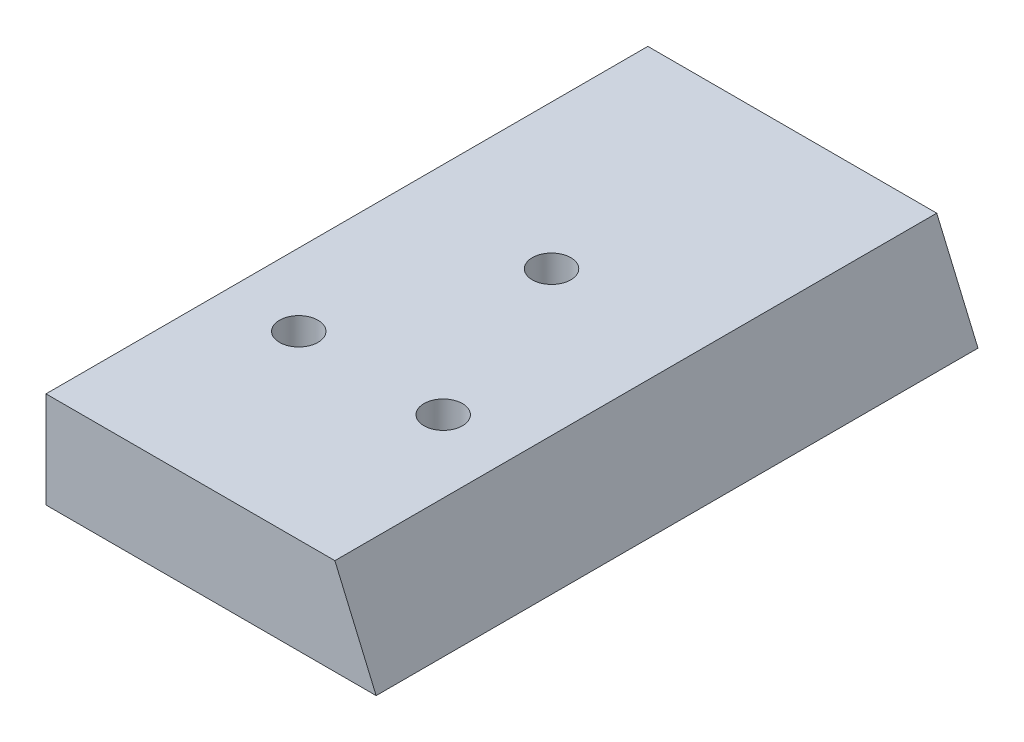
ISO-10303-21;
HEADER;
FILE_DESCRIPTION(('STEP AP214'),'2;1');
FILE_NAME('part.step','',(''),(''),'','','');
FILE_SCHEMA(('AUTOMOTIVE_DESIGN { 1 0 10303 214 1 1 1 1 }'));
ENDSEC;
DATA;
#1=APPLICATION_CONTEXT('core data for automotive mechanical design processes');
#2=APPLICATION_PROTOCOL_DEFINITION('international standard','automotive_design',2000,#1);
#3=PRODUCT_CONTEXT('',#1,'mechanical');
#4=PRODUCT('Part','Part','',(#3));
#5=PRODUCT_RELATED_PRODUCT_CATEGORY('part','',(#4));
#6=PRODUCT_DEFINITION_FORMATION('','',#4);
#7=PRODUCT_DEFINITION_CONTEXT('part definition',#1,'design');
#8=PRODUCT_DEFINITION('design','',#6,#7);
#9=PRODUCT_DEFINITION_SHAPE('','',#8);
#10=(LENGTH_UNIT() NAMED_UNIT(*) SI_UNIT(.MILLI.,.METRE.));
#11=(NAMED_UNIT(*) PLANE_ANGLE_UNIT() SI_UNIT($,.RADIAN.));
#12=(NAMED_UNIT(*) SI_UNIT($,.STERADIAN.) SOLID_ANGLE_UNIT());
#13=UNCERTAINTY_MEASURE_WITH_UNIT(LENGTH_MEASURE(1.E-05),#10,'distance_accuracy_value','');
#14=(GEOMETRIC_REPRESENTATION_CONTEXT(3) GLOBAL_UNCERTAINTY_ASSIGNED_CONTEXT((#13)) GLOBAL_UNIT_ASSIGNED_CONTEXT((#10,
#11,#12)) REPRESENTATION_CONTEXT('',''));
#15=CARTESIAN_POINT('',(0.,0.,0.));
#16=DIRECTION('',(0.,0.,1.));
#17=DIRECTION('',(1.,0.,0.));
#18=AXIS2_PLACEMENT_3D('',#15,#16,#17);
#19=CARTESIAN_POINT('',(0.,0.,0.));
#20=DIRECTION('',(0.,0.,1.));
#21=DIRECTION('',(1.,0.,0.));
#22=AXIS2_PLACEMENT_3D('',#19,#20,#21);
#23=PLANE('',#22);
#24=DIRECTION('',(-0.393919298579168,0.919145030018058,0.));
#25=VECTOR('',#24,1.);
#26=CARTESIAN_POINT('',(69.7615337539128,80.3248750291424,0.));
#27=LINE('',#26,#25);
#28=CARTESIAN_POINT('',(73.1901051824842,72.3248750291424,0.));
#29=VERTEX_POINT('',#28);
#30=CARTESIAN_POINT('',(69.7615337539128,80.3248750291424,0.));
#31=VERTEX_POINT('',#30);
#32=EDGE_CURVE('E81',#29,#31,#27,.T.);
#33=ORIENTED_EDGE('',*,*,#32,.F.);
#34=DIRECTION('',(1.,0.,0.));
#35=VECTOR('',#34,1.);
#36=CARTESIAN_POINT('',(45.7615337539128,72.3248750291424,0.));
#37=LINE('',#36,#35);
#38=CARTESIAN_POINT('',(45.7615337539128,72.3248750291424,0.));
#39=VERTEX_POINT('',#38);
#40=EDGE_CURVE('E87',#39,#29,#37,.T.);
#41=ORIENTED_EDGE('',*,*,#40,.F.);
#42=DIRECTION('',(0.,-1.,0.));
#43=VECTOR('',#42,1.);
#44=CARTESIAN_POINT('',(45.7615337539128,80.3248750291424,0.));
#45=LINE('',#44,#43);
#46=CARTESIAN_POINT('',(45.7615337539128,80.3248750291424,0.));
#47=VERTEX_POINT('',#46);
#48=EDGE_CURVE('E105',#47,#39,#45,.T.);
#49=ORIENTED_EDGE('',*,*,#48,.F.);
#50=DIRECTION('',(-1.,0.,0.));
#51=VECTOR('',#50,1.);
#52=CARTESIAN_POINT('',(45.7615337539128,80.3248750291424,0.));
#53=LINE('',#52,#51);
#54=EDGE_CURVE('E95',#31,#47,#53,.T.);
#55=ORIENTED_EDGE('',*,*,#54,.F.);
#56=EDGE_LOOP('',(#33,#41,#49,#55));
#57=FACE_BOUND('',#56,.T.);
#58=CARTESIAN_POINT('',(51.7615337539128,76.3248750291424,0.));
#59=DIRECTION('',(0.,0.,1.));
#60=DIRECTION('',(1.,0.,0.));
#61=AXIS2_PLACEMENT_3D('',#58,#59,#60);
#62=CIRCLE('',#61,1.9);
#63=CARTESIAN_POINT('',(53.6615337539128,76.3248750291424,0.));
#64=VERTEX_POINT('',#63);
#65=EDGE_CURVE('E129',#64,#64,#62,.T.);
#66=ORIENTED_EDGE('',*,*,#65,.T.);
#67=EDGE_LOOP('',(#66));
#68=FACE_BOUND('',#67,.T.);
#69=CARTESIAN_POINT('',(63.7615337539128,76.3248750291424,0.));
#70=DIRECTION('',(0.,0.,-1.));
#71=DIRECTION('',(-1.,0.,0.));
#72=AXIS2_PLACEMENT_3D('',#69,#70,#71);
#73=CIRCLE('',#72,1.9);
#74=CARTESIAN_POINT('',(61.8615337539128,76.3248750291424,0.));
#75=VERTEX_POINT('',#74);
#76=EDGE_CURVE('E132',#75,#75,#73,.T.);
#77=ORIENTED_EDGE('',*,*,#76,.F.);
#78=EDGE_LOOP('',(#77));
#79=FACE_BOUND('',#78,.T.);
#80=ADVANCED_FACE('F32',(#57,#68,#79),#23,.F.);
#81=CARTESIAN_POINT('',(45.7615337539128,80.3248750291424,78.5714285714286));
#82=DIRECTION('',(0.,-1.,0.));
#83=DIRECTION('',(0.,0.,-1.));
#84=AXIS2_PLACEMENT_3D('',#81,#82,#83);
#85=PLANE('',#84);
#86=CARTESIAN_POINT('',(63.7615337539128,80.3248750291424,35.));
#87=DIRECTION('',(0.,-1.,0.));
#88=DIRECTION('',(0.,0.,-1.));
#89=AXIS2_PLACEMENT_3D('',#86,#87,#88);
#90=CIRCLE('',#89,1.60000000000001);
#91=CARTESIAN_POINT('',(63.7615337539128,80.3248750291424,33.4));
#92=VERTEX_POINT('',#91);
#93=EDGE_CURVE('E116',#92,#92,#90,.F.);
#94=ORIENTED_EDGE('',*,*,#93,.F.);
#95=EDGE_LOOP('',(#94));
#96=FACE_BOUND('',#95,.T.);
#97=CARTESIAN_POINT('',(57.7615337539128,80.3248750291424,20.));
#98=DIRECTION('',(0.,-1.,0.));
#99=DIRECTION('',(0.,0.,-1.));
#100=AXIS2_PLACEMENT_3D('',#97,#98,#99);
#101=CIRCLE('',#100,1.6);
#102=CARTESIAN_POINT('',(57.7615337539128,80.3248750291424,18.4));
#103=VERTEX_POINT('',#102);
#104=EDGE_CURVE('E108',#103,#103,#101,.F.);
#105=ORIENTED_EDGE('',*,*,#104,.F.);
#106=EDGE_LOOP('',(#105));
#107=FACE_BOUND('',#106,.T.);
#108=DIRECTION('',(-1.,0.,0.));
#109=VECTOR('',#108,1.);
#110=CARTESIAN_POINT('',(45.7615337539128,80.3248750291424,50.));
#111=LINE('',#110,#109);
#112=CARTESIAN_POINT('',(69.7615337539128,80.3248750291424,50.));
#113=VERTEX_POINT('',#112);
#114=CARTESIAN_POINT('',(45.7615337539128,80.3248750291424,50.));
#115=VERTEX_POINT('',#114);
#116=EDGE_CURVE('E41',#113,#115,#111,.T.);
#117=ORIENTED_EDGE('',*,*,#116,.F.);
#118=DIRECTION('',(0.,0.,-1.));
#119=VECTOR('',#118,1.);
#120=CARTESIAN_POINT('',(69.7615337539128,80.3248750291424,78.5714285714286));
#121=LINE('',#120,#119);
#122=EDGE_CURVE('E71',#113,#31,#121,.T.);
#123=ORIENTED_EDGE('',*,*,#122,.T.);
#124=ORIENTED_EDGE('',*,*,#54,.T.);
#125=DIRECTION('',(0.,0.,-1.));
#126=VECTOR('',#125,1.);
#127=CARTESIAN_POINT('',(45.7615337539128,80.3248750291424,78.5714285714286));
#128=LINE('',#127,#126);
#129=EDGE_CURVE('E104',#115,#47,#128,.T.);
#130=ORIENTED_EDGE('',*,*,#129,.F.);
#131=EDGE_LOOP('',(#117,#123,#124,#130));
#132=FACE_BOUND('',#131,.T.);
#133=CARTESIAN_POINT('',(51.7615337539128,80.3248750291424,35.));
#134=DIRECTION('',(0.,-1.,0.));
#135=DIRECTION('',(0.,0.,-1.));
#136=AXIS2_PLACEMENT_3D('',#133,#134,#135);
#137=CIRCLE('',#136,1.60000000000001);
#138=CARTESIAN_POINT('',(51.7615337539128,80.3248750291424,33.4));
#139=VERTEX_POINT('',#138);
#140=EDGE_CURVE('E119',#139,#139,#137,.T.);
#141=ORIENTED_EDGE('',*,*,#140,.T.);
#142=EDGE_LOOP('',(#141));
#143=FACE_BOUND('',#142,.T.);
#144=ADVANCED_FACE('F148',(#96,#107,#132,#143),#85,.F.);
#145=CARTESIAN_POINT('',(45.7615337539128,72.3248750291424,78.5714285714286));
#146=DIRECTION('',(0.,1.,0.));
#147=DIRECTION('',(0.,0.,1.));
#148=AXIS2_PLACEMENT_3D('',#145,#146,#147);
#149=PLANE('',#148);
#150=CARTESIAN_POINT('',(63.7615337539128,72.3248750291424,35.));
#151=DIRECTION('',(0.,-1.,0.));
#152=DIRECTION('',(0.,0.,-1.));
#153=AXIS2_PLACEMENT_3D('',#150,#151,#152);
#154=CIRCLE('',#153,1.60000000000001);
#155=CARTESIAN_POINT('',(63.7615337539128,72.3248750291424,33.4));
#156=VERTEX_POINT('',#155);
#157=EDGE_CURVE('E111',#156,#156,#154,.T.);
#158=ORIENTED_EDGE('',*,*,#157,.F.);
#159=EDGE_LOOP('',(#158));
#160=FACE_BOUND('',#159,.T.);
#161=CARTESIAN_POINT('',(57.7615337539128,72.3248750291424,20.));
#162=DIRECTION('',(0.,-1.,0.));
#163=DIRECTION('',(0.,0.,-1.));
#164=AXIS2_PLACEMENT_3D('',#161,#162,#163);
#165=CIRCLE('',#164,1.6);
#166=CARTESIAN_POINT('',(57.7615337539128,72.3248750291424,18.4));
#167=VERTEX_POINT('',#166);
#168=EDGE_CURVE('E112',#167,#167,#165,.T.);
#169=ORIENTED_EDGE('',*,*,#168,.F.);
#170=EDGE_LOOP('',(#169));
#171=FACE_BOUND('',#170,.T.);
#172=DIRECTION('',(1.,0.,0.));
#173=VECTOR('',#172,1.);
#174=CARTESIAN_POINT('',(45.7615337539128,72.3248750291424,50.));
#175=LINE('',#174,#173);
#176=CARTESIAN_POINT('',(45.7615337539128,72.3248750291424,50.));
#177=VERTEX_POINT('',#176);
#178=CARTESIAN_POINT('',(73.1901051824842,72.3248750291424,50.));
#179=VERTEX_POINT('',#178);
#180=EDGE_CURVE('E92',#177,#179,#175,.T.);
#181=ORIENTED_EDGE('',*,*,#180,.F.);
#182=DIRECTION('',(0.,0.,-1.));
#183=VECTOR('',#182,1.);
#184=CARTESIAN_POINT('',(45.7615337539128,72.3248750291424,78.5714285714286));
#185=LINE('',#184,#183);
#186=EDGE_CURVE('E54',#177,#39,#185,.T.);
#187=ORIENTED_EDGE('',*,*,#186,.T.);
#188=ORIENTED_EDGE('',*,*,#40,.T.);
#189=DIRECTION('',(0.,0.,-1.));
#190=VECTOR('',#189,1.);
#191=CARTESIAN_POINT('',(73.1901051824842,72.3248750291424,78.5714285714286));
#192=LINE('',#191,#190);
#193=EDGE_CURVE('E36',#179,#29,#192,.T.);
#194=ORIENTED_EDGE('',*,*,#193,.F.);
#195=EDGE_LOOP('',(#181,#187,#188,#194));
#196=FACE_BOUND('',#195,.T.);
#197=CARTESIAN_POINT('',(51.7615337539128,72.3248750291424,35.));
#198=DIRECTION('',(0.,-1.,0.));
#199=DIRECTION('',(0.,0.,-1.));
#200=AXIS2_PLACEMENT_3D('',#197,#198,#199);
#201=CIRCLE('',#200,1.60000000000001);
#202=CARTESIAN_POINT('',(51.7615337539128,72.3248750291424,33.4));
#203=VERTEX_POINT('',#202);
#204=EDGE_CURVE('E85',#203,#203,#201,.F.);
#205=ORIENTED_EDGE('',*,*,#204,.T.);
#206=EDGE_LOOP('',(#205));
#207=FACE_BOUND('',#206,.T.);
#208=ADVANCED_FACE('F88',(#160,#171,#196,#207),#149,.F.);
#209=CARTESIAN_POINT('',(69.7615337539128,80.3248750291424,78.5714285714286));
#210=DIRECTION('',(-0.919145030018058,-0.393919298579168,0.));
#211=DIRECTION('',(0.393919298579168,-0.919145030018058,0.));
#212=AXIS2_PLACEMENT_3D('',#209,#210,#211);
#213=PLANE('',#212);
#214=DIRECTION('',(-0.393919298579168,0.919145030018058,0.));
#215=VECTOR('',#214,1.);
#216=CARTESIAN_POINT('',(69.7615337539128,80.3248750291424,50.));
#217=LINE('',#216,#215);
#218=EDGE_CURVE('E83',#179,#113,#217,.T.);
#219=ORIENTED_EDGE('',*,*,#218,.F.);
#220=ORIENTED_EDGE('',*,*,#193,.T.);
#221=ORIENTED_EDGE('',*,*,#32,.T.);
#222=ORIENTED_EDGE('',*,*,#122,.F.);
#223=EDGE_LOOP('',(#219,#220,#221,#222));
#224=FACE_BOUND('',#223,.T.);
#225=ADVANCED_FACE('F79',(#224),#213,.F.);
#226=CARTESIAN_POINT('',(45.7615337539128,80.3248750291424,78.5714285714286));
#227=DIRECTION('',(1.,0.,0.));
#228=DIRECTION('',(0.,0.,-1.));
#229=AXIS2_PLACEMENT_3D('',#226,#227,#228);
#230=PLANE('',#229);
#231=DIRECTION('',(0.,-1.,0.));
#232=VECTOR('',#231,1.);
#233=CARTESIAN_POINT('',(45.7615337539128,80.3248750291424,50.));
#234=LINE('',#233,#232);
#235=EDGE_CURVE('E11',#115,#177,#234,.T.);
#236=ORIENTED_EDGE('',*,*,#235,.F.);
#237=ORIENTED_EDGE('',*,*,#129,.T.);
#238=ORIENTED_EDGE('',*,*,#48,.T.);
#239=ORIENTED_EDGE('',*,*,#186,.F.);
#240=EDGE_LOOP('',(#236,#237,#238,#239));
#241=FACE_BOUND('',#240,.T.);
#242=ADVANCED_FACE('F162',(#241),#230,.F.);
#243=CARTESIAN_POINT('',(0.,0.,50.));
#244=DIRECTION('',(0.,0.,1.));
#245=DIRECTION('',(1.,0.,0.));
#246=AXIS2_PLACEMENT_3D('',#243,#244,#245);
#247=PLANE('',#246);
#248=ORIENTED_EDGE('',*,*,#180,.T.);
#249=ORIENTED_EDGE('',*,*,#218,.T.);
#250=ORIENTED_EDGE('',*,*,#116,.T.);
#251=ORIENTED_EDGE('',*,*,#235,.T.);
#252=EDGE_LOOP('',(#248,#249,#250,#251));
#253=FACE_BOUND('',#252,.T.);
#254=ADVANCED_FACE('F34',(#253),#247,.T.);
#255=CARTESIAN_POINT('',(57.7615337539128,80.3258750291424,20.));
#256=DIRECTION('',(0.,-1.,0.));
#257=DIRECTION('',(0.,0.,-1.));
#258=AXIS2_PLACEMENT_3D('',#255,#256,#257);
#259=CYLINDRICAL_SURFACE('',#258,1.6);
#260=ORIENTED_EDGE('',*,*,#168,.T.);
#261=EDGE_LOOP('',(#260));
#262=FACE_BOUND('',#261,.T.);
#263=ORIENTED_EDGE('',*,*,#104,.T.);
#264=EDGE_LOOP('',(#263));
#265=FACE_BOUND('',#264,.T.);
#266=ADVANCED_FACE('F157',(#262,#265),#259,.F.);
#267=CARTESIAN_POINT('',(63.7615337539128,80.3258750291424,35.));
#268=DIRECTION('',(0.,-1.,0.));
#269=DIRECTION('',(0.,0.,-1.));
#270=AXIS2_PLACEMENT_3D('',#267,#268,#269);
#271=CYLINDRICAL_SURFACE('',#270,1.60000000000001);
#272=ORIENTED_EDGE('',*,*,#157,.T.);
#273=EDGE_LOOP('',(#272));
#274=FACE_BOUND('',#273,.T.);
#275=ORIENTED_EDGE('',*,*,#93,.T.);
#276=EDGE_LOOP('',(#275));
#277=FACE_BOUND('',#276,.T.);
#278=ADVANCED_FACE('F186',(#274,#277),#271,.F.);
#279=CARTESIAN_POINT('',(51.7615337539128,80.3258750291424,35.));
#280=DIRECTION('',(0.,-1.,0.));
#281=DIRECTION('',(0.,0.,-1.));
#282=AXIS2_PLACEMENT_3D('',#279,#280,#281);
#283=CYLINDRICAL_SURFACE('',#282,1.60000000000001);
#284=ORIENTED_EDGE('',*,*,#204,.F.);
#285=EDGE_LOOP('',(#284));
#286=FACE_BOUND('',#285,.T.);
#287=ORIENTED_EDGE('',*,*,#140,.F.);
#288=EDGE_LOOP('',(#287));
#289=FACE_BOUND('',#288,.T.);
#290=ADVANCED_FACE('F193',(#286,#289),#283,.F.);
#291=CARTESIAN_POINT('',(51.7615337539128,76.3248750291424,10.));
#292=DIRECTION('',(0.,0.,-1.));
#293=DIRECTION('',(-1.,0.,0.));
#294=AXIS2_PLACEMENT_3D('',#291,#292,#293);
#295=CYLINDRICAL_SURFACE('',#294,1.9);
#296=CARTESIAN_POINT('',(51.7615337539128,76.3248750291424,10.));
#297=DIRECTION('',(0.,0.,1.));
#298=DIRECTION('',(1.,0.,0.));
#299=AXIS2_PLACEMENT_3D('',#296,#297,#298);
#300=CIRCLE('',#299,1.9);
#301=CARTESIAN_POINT('',(53.6615337539128,76.3248750291424,10.));
#302=VERTEX_POINT('',#301);
#303=EDGE_CURVE('E126',#302,#302,#300,.T.);
#304=ORIENTED_EDGE('',*,*,#303,.T.);
#305=EDGE_LOOP('',(#304));
#306=FACE_BOUND('',#305,.T.);
#307=ORIENTED_EDGE('',*,*,#65,.F.);
#308=EDGE_LOOP('',(#307));
#309=FACE_BOUND('',#308,.T.);
#310=ADVANCED_FACE('F200',(#306,#309),#295,.F.);
#311=CARTESIAN_POINT('',(51.7615337539128,76.3248750291424,10.));
#312=DIRECTION('',(0.,0.,1.));
#313=DIRECTION('',(1.,0.,0.));
#314=AXIS2_PLACEMENT_3D('',#311,#312,#313);
#315=PLANE('',#314);
#316=ORIENTED_EDGE('',*,*,#303,.F.);
#317=EDGE_LOOP('',(#316));
#318=FACE_BOUND('',#317,.T.);
#319=ADVANCED_FACE('F143',(#318),#315,.F.);
#320=CARTESIAN_POINT('',(63.7615337539128,76.3248750291424,10.));
#321=DIRECTION('',(0.,0.,-1.));
#322=DIRECTION('',(-1.,0.,0.));
#323=AXIS2_PLACEMENT_3D('',#320,#321,#322);
#324=CYLINDRICAL_SURFACE('',#323,1.9);
#325=CARTESIAN_POINT('',(63.7615337539128,76.3248750291424,10.));
#326=DIRECTION('',(0.,0.,-1.));
#327=DIRECTION('',(-1.,0.,0.));
#328=AXIS2_PLACEMENT_3D('',#325,#326,#327);
#329=CIRCLE('',#328,1.9);
#330=CARTESIAN_POINT('',(61.8615337539128,76.3248750291424,10.));
#331=VERTEX_POINT('',#330);
#332=EDGE_CURVE('E115',#331,#331,#329,.T.);
#333=ORIENTED_EDGE('',*,*,#332,.F.);
#334=EDGE_LOOP('',(#333));
#335=FACE_BOUND('',#334,.T.);
#336=ORIENTED_EDGE('',*,*,#76,.T.);
#337=EDGE_LOOP('',(#336));
#338=FACE_BOUND('',#337,.T.);
#339=ADVANCED_FACE('F140',(#335,#338),#324,.F.);
#340=CARTESIAN_POINT('',(63.7615337539128,76.3248750291424,10.));
#341=DIRECTION('',(0.,0.,-1.));
#342=DIRECTION('',(-1.,0.,0.));
#343=AXIS2_PLACEMENT_3D('',#340,#341,#342);
#344=PLANE('',#343);
#345=ORIENTED_EDGE('',*,*,#332,.T.);
#346=EDGE_LOOP('',(#345));
#347=FACE_BOUND('',#346,.T.);
#348=ADVANCED_FACE('F138',(#347),#344,.T.);
#349=CLOSED_SHELL('',(#80,#144,#208,#225,#242,#254,#266,#278,#290,#310,#319,#339,#348));
#350=MANIFOLD_SOLID_BREP('B2',#349);
#351=ADVANCED_BREP_SHAPE_REPRESENTATION('',(#18,#350),#14);
#352=SHAPE_DEFINITION_REPRESENTATION(#9,#351);
ENDSEC;
END-ISO-10303-21;
